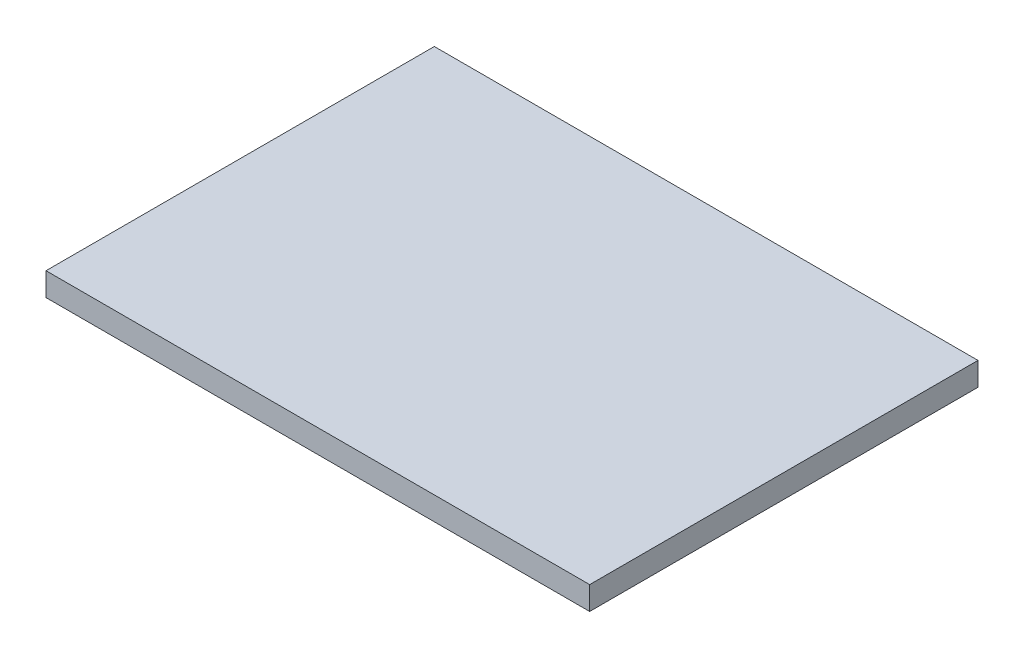
ISO-10303-21;
HEADER;
FILE_DESCRIPTION(('STEP AP214'),'2;1');
FILE_NAME('part.step','',(''),(''),'','','');
FILE_SCHEMA(('AUTOMOTIVE_DESIGN { 1 0 10303 214 1 1 1 1 }'));
ENDSEC;
DATA;
#1=APPLICATION_CONTEXT('core data for automotive mechanical design processes');
#2=APPLICATION_PROTOCOL_DEFINITION('international standard','automotive_design',2000,#1);
#3=PRODUCT_CONTEXT('',#1,'mechanical');
#4=PRODUCT('Part','Part','',(#3));
#5=PRODUCT_RELATED_PRODUCT_CATEGORY('part','',(#4));
#6=PRODUCT_DEFINITION_FORMATION('','',#4);
#7=PRODUCT_DEFINITION_CONTEXT('part definition',#1,'design');
#8=PRODUCT_DEFINITION('design','',#6,#7);
#9=PRODUCT_DEFINITION_SHAPE('','',#8);
#10=(LENGTH_UNIT() NAMED_UNIT(*) SI_UNIT(.MILLI.,.METRE.));
#11=(NAMED_UNIT(*) PLANE_ANGLE_UNIT() SI_UNIT($,.RADIAN.));
#12=(NAMED_UNIT(*) SI_UNIT($,.STERADIAN.) SOLID_ANGLE_UNIT());
#13=UNCERTAINTY_MEASURE_WITH_UNIT(LENGTH_MEASURE(1.E-05),#10,'distance_accuracy_value','');
#14=(GEOMETRIC_REPRESENTATION_CONTEXT(3) GLOBAL_UNCERTAINTY_ASSIGNED_CONTEXT((#13)) GLOBAL_UNIT_ASSIGNED_CONTEXT((#10,
#11,#12)) REPRESENTATION_CONTEXT('',''));
#15=CARTESIAN_POINT('',(0.,0.,0.));
#16=DIRECTION('',(0.,0.,1.));
#17=DIRECTION('',(1.,0.,0.));
#18=AXIS2_PLACEMENT_3D('',#15,#16,#17);
#19=CARTESIAN_POINT('',(35.,3.,-25.));
#20=DIRECTION('',(-1.,0.,0.));
#21=DIRECTION('',(0.,0.,1.));
#22=AXIS2_PLACEMENT_3D('',#19,#20,#21);
#23=PLANE('',#22);
#24=DIRECTION('',(0.,0.,-1.));
#25=VECTOR('',#24,1.);
#26=CARTESIAN_POINT('',(35.,0.,-25.));
#27=LINE('',#26,#25);
#28=CARTESIAN_POINT('',(35.,0.,25.));
#29=VERTEX_POINT('',#28);
#30=CARTESIAN_POINT('',(35.,0.,-25.));
#31=VERTEX_POINT('',#30);
#32=EDGE_CURVE('E113',#29,#31,#27,.T.);
#33=ORIENTED_EDGE('',*,*,#32,.T.);
#34=DIRECTION('',(0.,-1.,0.));
#35=VECTOR('',#34,1.);
#36=CARTESIAN_POINT('',(35.,3.,-25.));
#37=LINE('',#36,#35);
#38=CARTESIAN_POINT('',(35.,3.,-25.));
#39=VERTEX_POINT('',#38);
#40=EDGE_CURVE('E11',#39,#31,#37,.T.);
#41=ORIENTED_EDGE('',*,*,#40,.F.);
#42=DIRECTION('',(0.,0.,-1.));
#43=VECTOR('',#42,1.);
#44=CARTESIAN_POINT('',(35.,3.,-25.));
#45=LINE('',#44,#43);
#46=CARTESIAN_POINT('',(35.,3.,25.));
#47=VERTEX_POINT('',#46);
#48=EDGE_CURVE('E97',#47,#39,#45,.T.);
#49=ORIENTED_EDGE('',*,*,#48,.F.);
#50=DIRECTION('',(0.,-1.,0.));
#51=VECTOR('',#50,1.);
#52=CARTESIAN_POINT('',(35.,3.,25.));
#53=LINE('',#52,#51);
#54=EDGE_CURVE('E109',#47,#29,#53,.T.);
#55=ORIENTED_EDGE('',*,*,#54,.T.);
#56=EDGE_LOOP('',(#33,#41,#49,#55));
#57=FACE_BOUND('',#56,.T.);
#58=ADVANCED_FACE('F45',(#57),#23,.F.);
#59=CARTESIAN_POINT('',(-35.,3.,-25.));
#60=DIRECTION('',(0.,0.,1.));
#61=DIRECTION('',(1.,0.,0.));
#62=AXIS2_PLACEMENT_3D('',#59,#60,#61);
#63=PLANE('',#62);
#64=DIRECTION('',(-1.,0.,0.));
#65=VECTOR('',#64,1.);
#66=CARTESIAN_POINT('',(-35.,0.,-25.));
#67=LINE('',#66,#65);
#68=CARTESIAN_POINT('',(-35.,0.,-25.));
#69=VERTEX_POINT('',#68);
#70=EDGE_CURVE('E102',#31,#69,#67,.T.);
#71=ORIENTED_EDGE('',*,*,#70,.T.);
#72=DIRECTION('',(0.,-1.,0.));
#73=VECTOR('',#72,1.);
#74=CARTESIAN_POINT('',(-35.,3.,-25.));
#75=LINE('',#74,#73);
#76=CARTESIAN_POINT('',(-35.,3.,-25.));
#77=VERTEX_POINT('',#76);
#78=EDGE_CURVE('E54',#77,#69,#75,.T.);
#79=ORIENTED_EDGE('',*,*,#78,.F.);
#80=DIRECTION('',(-1.,0.,0.));
#81=VECTOR('',#80,1.);
#82=CARTESIAN_POINT('',(-35.,3.,-25.));
#83=LINE('',#82,#81);
#84=EDGE_CURVE('E92',#39,#77,#83,.T.);
#85=ORIENTED_EDGE('',*,*,#84,.F.);
#86=ORIENTED_EDGE('',*,*,#40,.T.);
#87=EDGE_LOOP('',(#71,#79,#85,#86));
#88=FACE_BOUND('',#87,.T.);
#89=ADVANCED_FACE('F101',(#88),#63,.F.);
#90=CARTESIAN_POINT('',(-35.,3.,-25.));
#91=DIRECTION('',(1.,0.,0.));
#92=DIRECTION('',(0.,0.,-1.));
#93=AXIS2_PLACEMENT_3D('',#90,#91,#92);
#94=PLANE('',#93);
#95=DIRECTION('',(0.,0.,1.));
#96=VECTOR('',#95,1.);
#97=CARTESIAN_POINT('',(-35.,0.,-25.));
#98=LINE('',#97,#96);
#99=CARTESIAN_POINT('',(-35.,0.,25.));
#100=VERTEX_POINT('',#99);
#101=EDGE_CURVE('E79',#69,#100,#98,.T.);
#102=ORIENTED_EDGE('',*,*,#101,.T.);
#103=DIRECTION('',(0.,-1.,0.));
#104=VECTOR('',#103,1.);
#105=CARTESIAN_POINT('',(-35.,3.,25.));
#106=LINE('',#105,#104);
#107=CARTESIAN_POINT('',(-35.,3.,25.));
#108=VERTEX_POINT('',#107);
#109=EDGE_CURVE('E104',#108,#100,#106,.T.);
#110=ORIENTED_EDGE('',*,*,#109,.F.);
#111=DIRECTION('',(0.,0.,1.));
#112=VECTOR('',#111,1.);
#113=CARTESIAN_POINT('',(-35.,3.,-25.));
#114=LINE('',#113,#112);
#115=EDGE_CURVE('E95',#77,#108,#114,.T.);
#116=ORIENTED_EDGE('',*,*,#115,.F.);
#117=ORIENTED_EDGE('',*,*,#78,.T.);
#118=EDGE_LOOP('',(#102,#110,#116,#117));
#119=FACE_BOUND('',#118,.T.);
#120=ADVANCED_FACE('F105',(#119),#94,.F.);
#121=CARTESIAN_POINT('',(-35.,3.,25.));
#122=DIRECTION('',(0.,0.,-1.));
#123=DIRECTION('',(-1.,0.,0.));
#124=AXIS2_PLACEMENT_3D('',#121,#122,#123);
#125=PLANE('',#124);
#126=DIRECTION('',(1.,0.,0.));
#127=VECTOR('',#126,1.);
#128=CARTESIAN_POINT('',(-35.,0.,25.));
#129=LINE('',#128,#127);
#130=EDGE_CURVE('E85',#100,#29,#129,.T.);
#131=ORIENTED_EDGE('',*,*,#130,.T.);
#132=ORIENTED_EDGE('',*,*,#54,.F.);
#133=DIRECTION('',(1.,0.,0.));
#134=VECTOR('',#133,1.);
#135=CARTESIAN_POINT('',(-35.,3.,25.));
#136=LINE('',#135,#134);
#137=EDGE_CURVE('E62',#108,#47,#136,.T.);
#138=ORIENTED_EDGE('',*,*,#137,.F.);
#139=ORIENTED_EDGE('',*,*,#109,.T.);
#140=EDGE_LOOP('',(#131,#132,#138,#139));
#141=FACE_BOUND('',#140,.T.);
#142=ADVANCED_FACE('F126',(#141),#125,.F.);
#143=CARTESIAN_POINT('',(0.,3.,0.));
#144=DIRECTION('',(0.,1.,0.));
#145=DIRECTION('',(0.,0.,1.));
#146=AXIS2_PLACEMENT_3D('',#143,#144,#145);
#147=PLANE('',#146);
#148=ORIENTED_EDGE('',*,*,#48,.T.);
#149=ORIENTED_EDGE('',*,*,#84,.T.);
#150=ORIENTED_EDGE('',*,*,#115,.T.);
#151=ORIENTED_EDGE('',*,*,#137,.T.);
#152=EDGE_LOOP('',(#148,#149,#150,#151));
#153=FACE_BOUND('',#152,.T.);
#154=ADVANCED_FACE('F93',(#153),#147,.T.);
#155=CARTESIAN_POINT('',(0.,0.,0.));
#156=DIRECTION('',(0.,1.,0.));
#157=DIRECTION('',(0.,0.,1.));
#158=AXIS2_PLACEMENT_3D('',#155,#156,#157);
#159=PLANE('',#158);
#160=ORIENTED_EDGE('',*,*,#32,.F.);
#161=ORIENTED_EDGE('',*,*,#130,.F.);
#162=ORIENTED_EDGE('',*,*,#101,.F.);
#163=ORIENTED_EDGE('',*,*,#70,.F.);
#164=EDGE_LOOP('',(#160,#161,#162,#163));
#165=FACE_BOUND('',#164,.T.);
#166=ADVANCED_FACE('F129',(#165),#159,.F.);
#167=CLOSED_SHELL('',(#58,#89,#120,#142,#154,#166));
#168=MANIFOLD_SOLID_BREP('B2',#167);
#169=ADVANCED_BREP_SHAPE_REPRESENTATION('',(#18,#168),#14);
#170=SHAPE_DEFINITION_REPRESENTATION(#9,#169);
ENDSEC;
END-ISO-10303-21;
